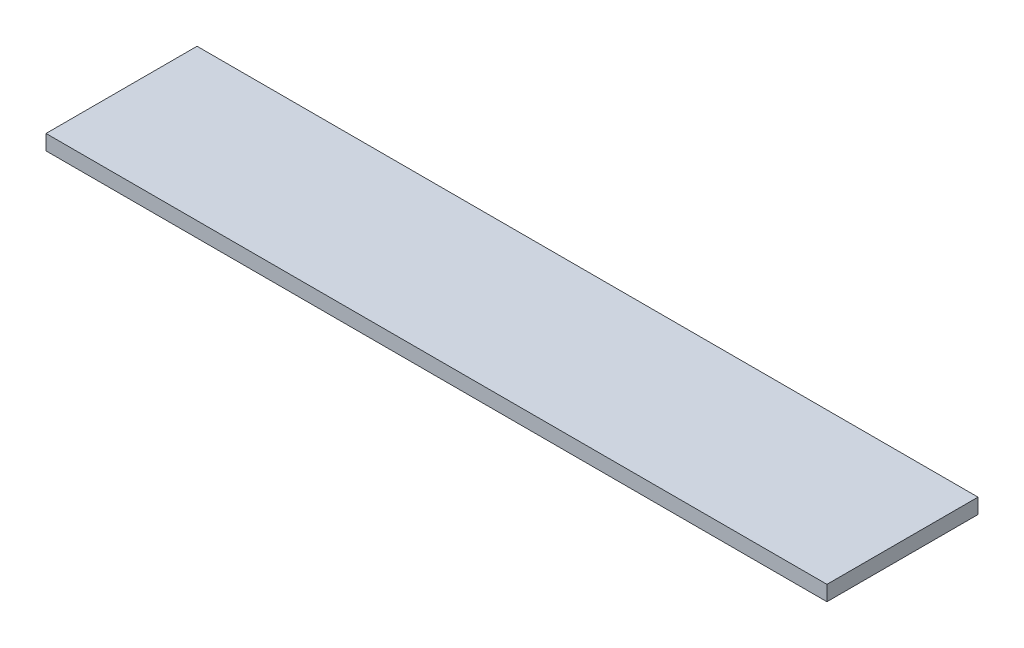
ISO-10303-21;
HEADER;
FILE_DESCRIPTION(('STEP AP214'),'2;1');
FILE_NAME('part.step','',(''),(''),'','','');
FILE_SCHEMA(('AUTOMOTIVE_DESIGN { 1 0 10303 214 1 1 1 1 }'));
ENDSEC;
DATA;
#1=APPLICATION_CONTEXT('core data for automotive mechanical design processes');
#2=APPLICATION_PROTOCOL_DEFINITION('international standard','automotive_design',2000,#1);
#3=PRODUCT_CONTEXT('',#1,'mechanical');
#4=PRODUCT('Part','Part','',(#3));
#5=PRODUCT_RELATED_PRODUCT_CATEGORY('part','',(#4));
#6=PRODUCT_DEFINITION_FORMATION('','',#4);
#7=PRODUCT_DEFINITION_CONTEXT('part definition',#1,'design');
#8=PRODUCT_DEFINITION('design','',#6,#7);
#9=PRODUCT_DEFINITION_SHAPE('','',#8);
#10=(LENGTH_UNIT() NAMED_UNIT(*) SI_UNIT(.MILLI.,.METRE.));
#11=(NAMED_UNIT(*) PLANE_ANGLE_UNIT() SI_UNIT($,.RADIAN.));
#12=(NAMED_UNIT(*) SI_UNIT($,.STERADIAN.) SOLID_ANGLE_UNIT());
#13=UNCERTAINTY_MEASURE_WITH_UNIT(LENGTH_MEASURE(1.E-05),#10,'distance_accuracy_value','');
#14=(GEOMETRIC_REPRESENTATION_CONTEXT(3) GLOBAL_UNCERTAINTY_ASSIGNED_CONTEXT((#13)) GLOBAL_UNIT_ASSIGNED_CONTEXT((#10,
#11,#12)) REPRESENTATION_CONTEXT('',''));
#15=CARTESIAN_POINT('',(0.,0.,0.));
#16=DIRECTION('',(0.,0.,1.));
#17=DIRECTION('',(1.,0.,0.));
#18=AXIS2_PLACEMENT_3D('',#15,#16,#17);
#19=CARTESIAN_POINT('',(0.,10.,0.));
#20=DIRECTION('',(1.,0.,0.));
#21=DIRECTION('',(0.,0.,-1.));
#22=AXIS2_PLACEMENT_3D('',#19,#20,#21);
#23=PLANE('',#22);
#24=DIRECTION('',(0.,0.,1.));
#25=VECTOR('',#24,1.);
#26=CARTESIAN_POINT('',(0.,0.,0.));
#27=LINE('',#26,#25);
#28=CARTESIAN_POINT('',(0.,0.,-100.));
#29=VERTEX_POINT('',#28);
#30=CARTESIAN_POINT('',(0.,0.,0.));
#31=VERTEX_POINT('',#30);
#32=EDGE_CURVE('E94',#29,#31,#27,.T.);
#33=ORIENTED_EDGE('',*,*,#32,.T.);
#34=DIRECTION('',(0.,-1.,0.));
#35=VECTOR('',#34,1.);
#36=CARTESIAN_POINT('',(0.,10.,0.));
#37=LINE('',#36,#35);
#38=CARTESIAN_POINT('',(0.,10.,0.));
#39=VERTEX_POINT('',#38);
#40=EDGE_CURVE('E11',#39,#31,#37,.T.);
#41=ORIENTED_EDGE('',*,*,#40,.F.);
#42=DIRECTION('',(0.,0.,1.));
#43=VECTOR('',#42,1.);
#44=CARTESIAN_POINT('',(0.,10.,0.));
#45=LINE('',#44,#43);
#46=CARTESIAN_POINT('',(0.,10.,-100.));
#47=VERTEX_POINT('',#46);
#48=EDGE_CURVE('E82',#47,#39,#45,.T.);
#49=ORIENTED_EDGE('',*,*,#48,.F.);
#50=DIRECTION('',(0.,-1.,0.));
#51=VECTOR('',#50,1.);
#52=CARTESIAN_POINT('',(0.,10.,-100.));
#53=LINE('',#52,#51);
#54=EDGE_CURVE('E90',#47,#29,#53,.T.);
#55=ORIENTED_EDGE('',*,*,#54,.T.);
#56=EDGE_LOOP('',(#33,#41,#49,#55));
#57=FACE_BOUND('',#56,.T.);
#58=ADVANCED_FACE('F31',(#57),#23,.F.);
#59=CARTESIAN_POINT('',(0.,10.,0.));
#60=DIRECTION('',(0.,0.,-1.));
#61=DIRECTION('',(-1.,0.,0.));
#62=AXIS2_PLACEMENT_3D('',#59,#60,#61);
#63=PLANE('',#62);
#64=DIRECTION('',(1.,0.,0.));
#65=VECTOR('',#64,1.);
#66=CARTESIAN_POINT('',(0.,0.,0.));
#67=LINE('',#66,#65);
#68=CARTESIAN_POINT('',(517.,0.,0.));
#69=VERTEX_POINT('',#68);
#70=EDGE_CURVE('E86',#31,#69,#67,.T.);
#71=ORIENTED_EDGE('',*,*,#70,.T.);
#72=DIRECTION('',(0.,-1.,0.));
#73=VECTOR('',#72,1.);
#74=CARTESIAN_POINT('',(517.,10.,0.));
#75=LINE('',#74,#73);
#76=CARTESIAN_POINT('',(517.,10.,0.));
#77=VERTEX_POINT('',#76);
#78=EDGE_CURVE('E39',#77,#69,#75,.T.);
#79=ORIENTED_EDGE('',*,*,#78,.F.);
#80=DIRECTION('',(1.,0.,0.));
#81=VECTOR('',#80,1.);
#82=CARTESIAN_POINT('',(0.,10.,0.));
#83=LINE('',#82,#81);
#84=EDGE_CURVE('E77',#39,#77,#83,.T.);
#85=ORIENTED_EDGE('',*,*,#84,.F.);
#86=ORIENTED_EDGE('',*,*,#40,.T.);
#87=EDGE_LOOP('',(#71,#79,#85,#86));
#88=FACE_BOUND('',#87,.T.);
#89=ADVANCED_FACE('F85',(#88),#63,.F.);
#90=CARTESIAN_POINT('',(517.,10.,0.));
#91=DIRECTION('',(-1.,0.,0.));
#92=DIRECTION('',(0.,0.,1.));
#93=AXIS2_PLACEMENT_3D('',#90,#91,#92);
#94=PLANE('',#93);
#95=DIRECTION('',(0.,0.,-1.));
#96=VECTOR('',#95,1.);
#97=CARTESIAN_POINT('',(517.,0.,0.));
#98=LINE('',#97,#96);
#99=CARTESIAN_POINT('',(517.,0.,-100.));
#100=VERTEX_POINT('',#99);
#101=EDGE_CURVE('E64',#69,#100,#98,.T.);
#102=ORIENTED_EDGE('',*,*,#101,.T.);
#103=DIRECTION('',(0.,-1.,0.));
#104=VECTOR('',#103,1.);
#105=CARTESIAN_POINT('',(517.,10.,-100.));
#106=LINE('',#105,#104);
#107=CARTESIAN_POINT('',(517.,10.,-100.));
#108=VERTEX_POINT('',#107);
#109=EDGE_CURVE('E87',#108,#100,#106,.T.);
#110=ORIENTED_EDGE('',*,*,#109,.F.);
#111=DIRECTION('',(0.,0.,-1.));
#112=VECTOR('',#111,1.);
#113=CARTESIAN_POINT('',(517.,10.,0.));
#114=LINE('',#113,#112);
#115=EDGE_CURVE('E80',#77,#108,#114,.T.);
#116=ORIENTED_EDGE('',*,*,#115,.F.);
#117=ORIENTED_EDGE('',*,*,#78,.T.);
#118=EDGE_LOOP('',(#102,#110,#116,#117));
#119=FACE_BOUND('',#118,.T.);
#120=ADVANCED_FACE('F88',(#119),#94,.F.);
#121=CARTESIAN_POINT('',(0.,10.,-100.));
#122=DIRECTION('',(0.,0.,1.));
#123=DIRECTION('',(1.,0.,0.));
#124=AXIS2_PLACEMENT_3D('',#121,#122,#123);
#125=PLANE('',#124);
#126=DIRECTION('',(-1.,0.,0.));
#127=VECTOR('',#126,1.);
#128=CARTESIAN_POINT('',(0.,0.,-100.));
#129=LINE('',#128,#127);
#130=EDGE_CURVE('E70',#100,#29,#129,.T.);
#131=ORIENTED_EDGE('',*,*,#130,.T.);
#132=ORIENTED_EDGE('',*,*,#54,.F.);
#133=DIRECTION('',(-1.,0.,0.));
#134=VECTOR('',#133,1.);
#135=CARTESIAN_POINT('',(0.,10.,-100.));
#136=LINE('',#135,#134);
#137=EDGE_CURVE('E47',#108,#47,#136,.T.);
#138=ORIENTED_EDGE('',*,*,#137,.F.);
#139=ORIENTED_EDGE('',*,*,#109,.T.);
#140=EDGE_LOOP('',(#131,#132,#138,#139));
#141=FACE_BOUND('',#140,.T.);
#142=ADVANCED_FACE('F101',(#141),#125,.F.);
#143=CARTESIAN_POINT('',(0.,10.,-100.));
#144=DIRECTION('',(0.,-1.,0.));
#145=DIRECTION('',(0.,0.,-1.));
#146=AXIS2_PLACEMENT_3D('',#143,#144,#145);
#147=PLANE('',#146);
#148=ORIENTED_EDGE('',*,*,#48,.T.);
#149=ORIENTED_EDGE('',*,*,#84,.T.);
#150=ORIENTED_EDGE('',*,*,#115,.T.);
#151=ORIENTED_EDGE('',*,*,#137,.T.);
#152=EDGE_LOOP('',(#148,#149,#150,#151));
#153=FACE_BOUND('',#152,.T.);
#154=ADVANCED_FACE('F78',(#153),#147,.F.);
#155=CARTESIAN_POINT('',(0.,0.,-100.));
#156=DIRECTION('',(0.,-1.,0.));
#157=DIRECTION('',(0.,0.,-1.));
#158=AXIS2_PLACEMENT_3D('',#155,#156,#157);
#159=PLANE('',#158);
#160=ORIENTED_EDGE('',*,*,#32,.F.);
#161=ORIENTED_EDGE('',*,*,#130,.F.);
#162=ORIENTED_EDGE('',*,*,#101,.F.);
#163=ORIENTED_EDGE('',*,*,#70,.F.);
#164=EDGE_LOOP('',(#160,#161,#162,#163));
#165=FACE_BOUND('',#164,.T.);
#166=ADVANCED_FACE('F104',(#165),#159,.T.);
#167=CLOSED_SHELL('',(#58,#89,#120,#142,#154,#166));
#168=MANIFOLD_SOLID_BREP('B2',#167);
#169=ADVANCED_BREP_SHAPE_REPRESENTATION('',(#18,#168),#14);
#170=SHAPE_DEFINITION_REPRESENTATION(#9,#169);
ENDSEC;
END-ISO-10303-21;
